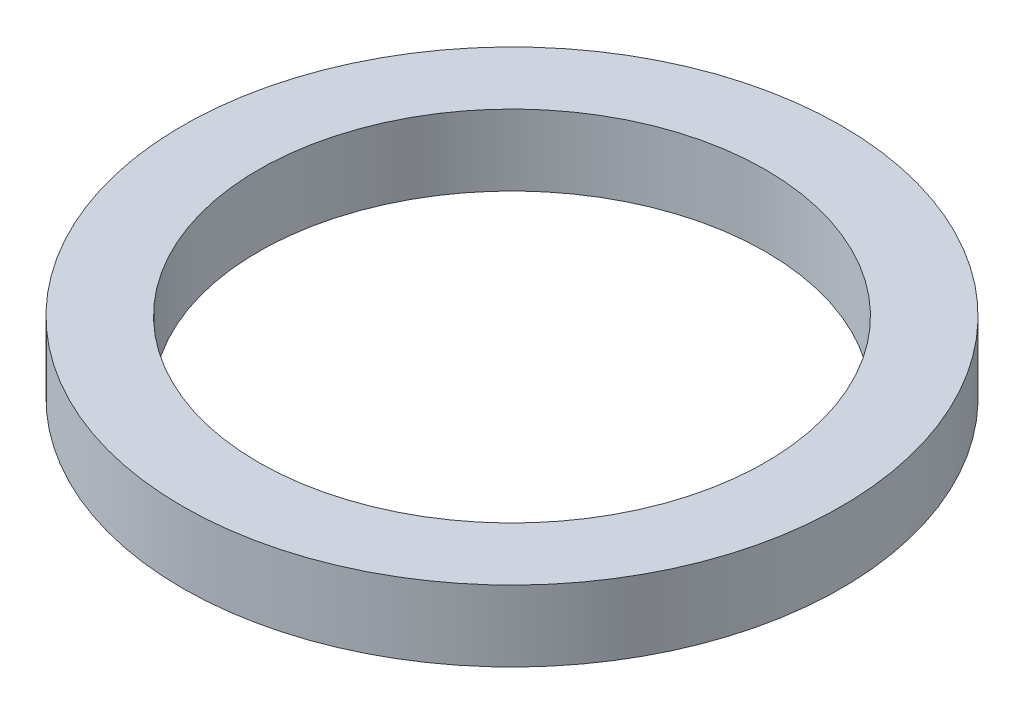
ISO-10303-21;
HEADER;
FILE_DESCRIPTION(('STEP AP214'),'2;1');
FILE_NAME('part.step','',(''),(''),'','','');
FILE_SCHEMA(('AUTOMOTIVE_DESIGN { 1 0 10303 214 1 1 1 1 }'));
ENDSEC;
DATA;
#1=APPLICATION_CONTEXT('core data for automotive mechanical design processes');
#2=APPLICATION_PROTOCOL_DEFINITION('international standard','automotive_design',2000,#1);
#3=PRODUCT_CONTEXT('',#1,'mechanical');
#4=PRODUCT('Part','Part','',(#3));
#5=PRODUCT_RELATED_PRODUCT_CATEGORY('part','',(#4));
#6=PRODUCT_DEFINITION_FORMATION('','',#4);
#7=PRODUCT_DEFINITION_CONTEXT('part definition',#1,'design');
#8=PRODUCT_DEFINITION('design','',#6,#7);
#9=PRODUCT_DEFINITION_SHAPE('','',#8);
#10=(LENGTH_UNIT() NAMED_UNIT(*) SI_UNIT(.MILLI.,.METRE.));
#11=(NAMED_UNIT(*) PLANE_ANGLE_UNIT() SI_UNIT($,.RADIAN.));
#12=(NAMED_UNIT(*) SI_UNIT($,.STERADIAN.) SOLID_ANGLE_UNIT());
#13=UNCERTAINTY_MEASURE_WITH_UNIT(LENGTH_MEASURE(1.E-05),#10,'distance_accuracy_value','');
#14=(GEOMETRIC_REPRESENTATION_CONTEXT(3) GLOBAL_UNCERTAINTY_ASSIGNED_CONTEXT((#13)) GLOBAL_UNIT_ASSIGNED_CONTEXT((#10,
#11,#12)) REPRESENTATION_CONTEXT('',''));
#15=CARTESIAN_POINT('',(0.,0.,0.));
#16=DIRECTION('',(0.,0.,1.));
#17=DIRECTION('',(1.,0.,0.));
#18=AXIS2_PLACEMENT_3D('',#15,#16,#17);
#19=CARTESIAN_POINT('',(0.,3.5,0.));
#20=DIRECTION('',(0.,1.,0.));
#21=DIRECTION('',(0.,0.,1.));
#22=AXIS2_PLACEMENT_3D('',#19,#20,#21);
#23=PLANE('',#22);
#24=CARTESIAN_POINT('',(0.,3.5,0.));
#25=DIRECTION('',(0.,1.,0.));
#26=DIRECTION('',(0.,0.,1.));
#27=AXIS2_PLACEMENT_3D('',#24,#25,#26);
#28=CIRCLE('',#27,32.5);
#29=CARTESIAN_POINT('',(0.,3.5,32.5));
#30=VERTEX_POINT('',#29);
#31=EDGE_CURVE('E10',#30,#30,#28,.T.);
#32=ORIENTED_EDGE('',*,*,#31,.T.);
#33=EDGE_LOOP('',(#32));
#34=FACE_BOUND('',#33,.T.);
#35=CARTESIAN_POINT('',(0.,3.5,0.));
#36=DIRECTION('',(0.,1.,0.));
#37=DIRECTION('',(0.,0.,1.));
#38=AXIS2_PLACEMENT_3D('',#35,#36,#37);
#39=CIRCLE('',#38,25.);
#40=CARTESIAN_POINT('',(0.,3.5,25.));
#41=VERTEX_POINT('',#40);
#42=EDGE_CURVE('E51',#41,#41,#39,.T.);
#43=ORIENTED_EDGE('',*,*,#42,.F.);
#44=EDGE_LOOP('',(#43));
#45=FACE_BOUND('',#44,.T.);
#46=ADVANCED_FACE('F38',(#34,#45),#23,.T.);
#47=CARTESIAN_POINT('',(0.,-3.5,0.));
#48=DIRECTION('',(0.,1.,0.));
#49=DIRECTION('',(0.,0.,1.));
#50=AXIS2_PLACEMENT_3D('',#47,#48,#49);
#51=PLANE('',#50);
#52=CARTESIAN_POINT('',(0.,-3.5,0.));
#53=DIRECTION('',(0.,1.,0.));
#54=DIRECTION('',(0.,0.,1.));
#55=AXIS2_PLACEMENT_3D('',#52,#53,#54);
#56=CIRCLE('',#55,32.5);
#57=CARTESIAN_POINT('',(0.,-3.5,32.5));
#58=VERTEX_POINT('',#57);
#59=EDGE_CURVE('E42',#58,#58,#56,.T.);
#60=ORIENTED_EDGE('',*,*,#59,.F.);
#61=EDGE_LOOP('',(#60));
#62=FACE_BOUND('',#61,.T.);
#63=CARTESIAN_POINT('',(0.,-3.5,0.));
#64=DIRECTION('',(0.,1.,0.));
#65=DIRECTION('',(0.,0.,1.));
#66=AXIS2_PLACEMENT_3D('',#63,#64,#65);
#67=CIRCLE('',#66,25.);
#68=CARTESIAN_POINT('',(0.,-3.5,25.));
#69=VERTEX_POINT('',#68);
#70=EDGE_CURVE('E53',#69,#69,#67,.T.);
#71=ORIENTED_EDGE('',*,*,#70,.T.);
#72=EDGE_LOOP('',(#71));
#73=FACE_BOUND('',#72,.T.);
#74=ADVANCED_FACE('F65',(#62,#73),#51,.F.);
#75=CARTESIAN_POINT('',(0.,3.5,0.));
#76=DIRECTION('',(0.,-1.,0.));
#77=DIRECTION('',(0.,0.,-1.));
#78=AXIS2_PLACEMENT_3D('',#75,#76,#77);
#79=CYLINDRICAL_SURFACE('',#78,32.5);
#80=ORIENTED_EDGE('',*,*,#31,.F.);
#81=EDGE_LOOP('',(#80));
#82=FACE_BOUND('',#81,.T.);
#83=ORIENTED_EDGE('',*,*,#59,.T.);
#84=EDGE_LOOP('',(#83));
#85=FACE_BOUND('',#84,.T.);
#86=ADVANCED_FACE('F40',(#82,#85),#79,.T.);
#87=CARTESIAN_POINT('',(0.,3.5,0.));
#88=DIRECTION('',(0.,-1.,0.));
#89=DIRECTION('',(0.,0.,-1.));
#90=AXIS2_PLACEMENT_3D('',#87,#88,#89);
#91=CYLINDRICAL_SURFACE('',#90,25.);
#92=ORIENTED_EDGE('',*,*,#42,.T.);
#93=EDGE_LOOP('',(#92));
#94=FACE_BOUND('',#93,.T.);
#95=ORIENTED_EDGE('',*,*,#70,.F.);
#96=EDGE_LOOP('',(#95));
#97=FACE_BOUND('',#96,.T.);
#98=ADVANCED_FACE('F61',(#94,#97),#91,.F.);
#99=CLOSED_SHELL('',(#46,#74,#86,#98));
#100=MANIFOLD_SOLID_BREP('B2',#99);
#101=ADVANCED_BREP_SHAPE_REPRESENTATION('',(#18,#100),#14);
#102=SHAPE_DEFINITION_REPRESENTATION(#9,#101);
ENDSEC;
END-ISO-10303-21;
